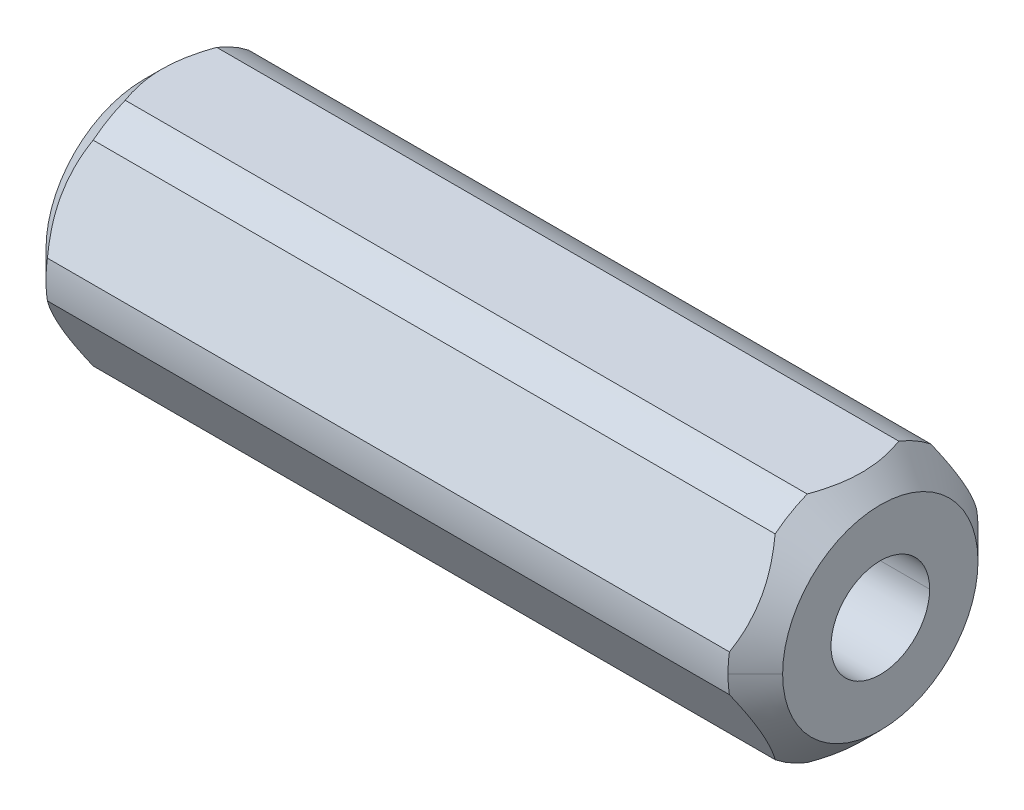
ISO-10303-21;
HEADER;
FILE_DESCRIPTION(('STEP AP214'),'2;1');
FILE_NAME('part.step','',(''),(''),'','','');
FILE_SCHEMA(('AUTOMOTIVE_DESIGN { 1 0 10303 214 1 1 1 1 }'));
ENDSEC;
DATA;
#1=APPLICATION_CONTEXT('core data for automotive mechanical design processes');
#2=APPLICATION_PROTOCOL_DEFINITION('international standard','automotive_design',2000,#1);
#3=PRODUCT_CONTEXT('',#1,'mechanical');
#4=PRODUCT('Part','Part','',(#3));
#5=PRODUCT_RELATED_PRODUCT_CATEGORY('part','',(#4));
#6=PRODUCT_DEFINITION_FORMATION('','',#4);
#7=PRODUCT_DEFINITION_CONTEXT('part definition',#1,'design');
#8=PRODUCT_DEFINITION('design','',#6,#7);
#9=PRODUCT_DEFINITION_SHAPE('','',#8);
#10=(LENGTH_UNIT() NAMED_UNIT(*) SI_UNIT(.MILLI.,.METRE.));
#11=(NAMED_UNIT(*) PLANE_ANGLE_UNIT() SI_UNIT($,.RADIAN.));
#12=(NAMED_UNIT(*) SI_UNIT($,.STERADIAN.) SOLID_ANGLE_UNIT());
#13=UNCERTAINTY_MEASURE_WITH_UNIT(LENGTH_MEASURE(1.E-05),#10,'distance_accuracy_value','');
#14=(GEOMETRIC_REPRESENTATION_CONTEXT(3) GLOBAL_UNCERTAINTY_ASSIGNED_CONTEXT((#13)) GLOBAL_UNIT_ASSIGNED_CONTEXT((#10,
#11,#12)) REPRESENTATION_CONTEXT('',''));
#15=CARTESIAN_POINT('',(0.,0.,0.));
#16=DIRECTION('',(0.,0.,1.));
#17=DIRECTION('',(1.,0.,0.));
#18=AXIS2_PLACEMENT_3D('',#15,#16,#17);
#19=CARTESIAN_POINT('',(-15.08125,0.,0.));
#20=DIRECTION('',(1.,0.,0.));
#21=DIRECTION('',(0.,0.,-1.));
#22=AXIS2_PLACEMENT_3D('',#19,#20,#21);
#23=CYLINDRICAL_SURFACE('',#22,5.1181);
#24=CARTESIAN_POINT('',(-13.96315,0.,0.));
#25=DIRECTION('',(1.,0.,0.));
#26=DIRECTION('',(0.,0.,-1.));
#27=AXIS2_PLACEMENT_3D('',#24,#25,#26);
#28=CIRCLE('',#27,5.1181);
#29=CARTESIAN_POINT('',(-13.96315,4.7625,1.87444428031358));
#30=VERTEX_POINT('',#29);
#31=CARTESIAN_POINT('',(-13.96315,4.00456636472995,3.18722384536662));
#32=VERTEX_POINT('',#31);
#33=EDGE_CURVE('E603',#30,#32,#28,.T.);
#34=ORIENTED_EDGE('',*,*,#33,.T.);
#35=DIRECTION('',(1.,0.,0.));
#36=VECTOR('',#35,1.);
#37=CARTESIAN_POINT('',(-15.08125,4.00456636472995,3.18722384536662));
#38=LINE('',#37,#36);
#39=CARTESIAN_POINT('',(13.96315,4.00456636472997,3.1872238453666));
#40=VERTEX_POINT('',#39);
#41=EDGE_CURVE('E619',#32,#40,#38,.T.);
#42=ORIENTED_EDGE('',*,*,#41,.T.);
#43=CARTESIAN_POINT('',(13.96315,0.,0.));
#44=DIRECTION('',(-1.,0.,0.));
#45=DIRECTION('',(0.,0.,1.));
#46=AXIS2_PLACEMENT_3D('',#43,#44,#45);
#47=CIRCLE('',#46,5.1181);
#48=CARTESIAN_POINT('',(13.96315,4.7625,1.87444428031359));
#49=VERTEX_POINT('',#48);
#50=EDGE_CURVE('E219',#40,#49,#47,.T.);
#51=ORIENTED_EDGE('',*,*,#50,.T.);
#52=DIRECTION('',(-1.,0.,0.));
#53=VECTOR('',#52,1.);
#54=CARTESIAN_POINT('',(-15.08125,4.7625,1.87444428031358));
#55=LINE('',#54,#53);
#56=EDGE_CURVE('E514',#49,#30,#55,.T.);
#57=ORIENTED_EDGE('',*,*,#56,.T.);
#58=EDGE_LOOP('',(#34,#42,#51,#57));
#59=FACE_BOUND('',#58,.T.);
#60=ADVANCED_FACE('F16',(#59),#23,.T.);
#61=CARTESIAN_POINT('',(-15.08125,0.,0.));
#62=DIRECTION('',(1.,0.,0.));
#63=DIRECTION('',(0.,0.,-1.));
#64=AXIS2_PLACEMENT_3D('',#61,#62,#63);
#65=CYLINDRICAL_SURFACE('',#64,5.1181);
#66=CARTESIAN_POINT('',(-13.96315,0.,0.));
#67=DIRECTION('',(1.,0.,0.));
#68=DIRECTION('',(0.,0.,-1.));
#69=AXIS2_PLACEMENT_3D('',#66,#67,#68);
#70=CIRCLE('',#69,5.1181);
#71=CARTESIAN_POINT('',(-13.96315,4.00456636472997,-3.18722384536659));
#72=VERTEX_POINT('',#71);
#73=CARTESIAN_POINT('',(-13.96315,4.7625,-1.87444428031355));
#74=VERTEX_POINT('',#73);
#75=EDGE_CURVE('E575',#72,#74,#70,.T.);
#76=ORIENTED_EDGE('',*,*,#75,.T.);
#77=DIRECTION('',(1.,0.,0.));
#78=VECTOR('',#77,1.);
#79=CARTESIAN_POINT('',(-15.08125,4.7625,-1.87444428031355));
#80=LINE('',#79,#78);
#81=CARTESIAN_POINT('',(13.96315,4.7625,-1.87444428031353));
#82=VERTEX_POINT('',#81);
#83=EDGE_CURVE('E523',#74,#82,#80,.T.);
#84=ORIENTED_EDGE('',*,*,#83,.T.);
#85=CARTESIAN_POINT('',(13.96315,0.,0.));
#86=DIRECTION('',(-1.,0.,0.));
#87=DIRECTION('',(0.,0.,1.));
#88=AXIS2_PLACEMENT_3D('',#85,#86,#87);
#89=CIRCLE('',#88,5.1181);
#90=CARTESIAN_POINT('',(13.96315,4.00456636472995,-3.1872238453666));
#91=VERTEX_POINT('',#90);
#92=EDGE_CURVE('E168',#82,#91,#89,.T.);
#93=ORIENTED_EDGE('',*,*,#92,.T.);
#94=DIRECTION('',(-1.,0.,0.));
#95=VECTOR('',#94,1.);
#96=CARTESIAN_POINT('',(-15.08125,4.00456636472997,-3.18722384536659));
#97=LINE('',#96,#95);
#98=EDGE_CURVE('E493',#91,#72,#97,.T.);
#99=ORIENTED_EDGE('',*,*,#98,.T.);
#100=EDGE_LOOP('',(#76,#84,#93,#99));
#101=FACE_BOUND('',#100,.T.);
#102=ADVANCED_FACE('F887',(#101),#65,.T.);
#103=CARTESIAN_POINT('',(-15.08125,0.,0.));
#104=DIRECTION('',(1.,0.,0.));
#105=DIRECTION('',(0.,0.,-1.));
#106=AXIS2_PLACEMENT_3D('',#103,#104,#105);
#107=CYLINDRICAL_SURFACE('',#106,5.1181);
#108=DIRECTION('',(1.,0.,0.));
#109=VECTOR('',#108,1.);
#110=CARTESIAN_POINT('',(-15.08125,0.,-5.1181));
#111=LINE('',#110,#109);
#112=CARTESIAN_POINT('',(-13.96315,0.,-5.1181));
#113=VERTEX_POINT('',#112);
#114=CARTESIAN_POINT('',(13.96315,0.,-5.1181));
#115=VERTEX_POINT('',#114);
#116=EDGE_CURVE('E256',#113,#115,#111,.T.);
#117=ORIENTED_EDGE('',*,*,#116,.F.);
#118=CARTESIAN_POINT('',(-13.96315,0.,0.));
#119=DIRECTION('',(1.,0.,0.));
#120=DIRECTION('',(0.,0.,-1.));
#121=AXIS2_PLACEMENT_3D('',#118,#119,#120);
#122=CIRCLE('',#121,5.1181);
#123=CARTESIAN_POINT('',(-13.96315,0.757933635270015,-5.06166812568015));
#124=VERTEX_POINT('',#123);
#125=EDGE_CURVE('E569',#113,#124,#122,.T.);
#126=ORIENTED_EDGE('',*,*,#125,.T.);
#127=DIRECTION('',(1.,0.,0.));
#128=VECTOR('',#127,1.);
#129=CARTESIAN_POINT('',(-15.08125,0.757933635270015,-5.06166812568015));
#130=LINE('',#129,#128);
#131=CARTESIAN_POINT('',(13.96315,0.757933635270053,-5.06166812568013));
#132=VERTEX_POINT('',#131);
#133=EDGE_CURVE('E540',#124,#132,#130,.T.);
#134=ORIENTED_EDGE('',*,*,#133,.T.);
#135=CARTESIAN_POINT('',(13.96315,0.,0.));
#136=DIRECTION('',(-1.,0.,0.));
#137=DIRECTION('',(0.,0.,1.));
#138=AXIS2_PLACEMENT_3D('',#135,#136,#137);
#139=CIRCLE('',#138,5.1181);
#140=EDGE_CURVE('E179',#132,#115,#139,.T.);
#141=ORIENTED_EDGE('',*,*,#140,.T.);
#142=EDGE_LOOP('',(#117,#126,#134,#141));
#143=FACE_BOUND('',#142,.T.);
#144=ADVANCED_FACE('F559',(#143),#107,.T.);
#145=CARTESIAN_POINT('',(-15.08125,0.,0.));
#146=DIRECTION('',(1.,0.,0.));
#147=DIRECTION('',(0.,0.,-1.));
#148=AXIS2_PLACEMENT_3D('',#145,#146,#147);
#149=CYLINDRICAL_SURFACE('',#148,5.1181);
#150=CARTESIAN_POINT('',(-13.96315,0.,0.));
#151=DIRECTION('',(1.,0.,0.));
#152=DIRECTION('',(0.,0.,-1.));
#153=AXIS2_PLACEMENT_3D('',#150,#151,#152);
#154=CIRCLE('',#153,5.1181);
#155=CARTESIAN_POINT('',(-13.96315,-4.7625,-1.87444428031361));
#156=VERTEX_POINT('',#155);
#157=CARTESIAN_POINT('',(-13.96315,-4.00456636472992,-3.18722384536665));
#158=VERTEX_POINT('',#157);
#159=EDGE_CURVE('E43',#156,#158,#154,.T.);
#160=ORIENTED_EDGE('',*,*,#159,.T.);
#161=DIRECTION('',(1.,0.,0.));
#162=VECTOR('',#161,1.);
#163=CARTESIAN_POINT('',(-15.08125,-4.00456636472992,-3.18722384536665));
#164=LINE('',#163,#162);
#165=CARTESIAN_POINT('',(13.96315,-4.0045663647299,-3.18722384536667));
#166=VERTEX_POINT('',#165);
#167=EDGE_CURVE('E433',#158,#166,#164,.T.);
#168=ORIENTED_EDGE('',*,*,#167,.T.);
#169=CARTESIAN_POINT('',(13.96315,0.,0.));
#170=DIRECTION('',(-1.,0.,0.));
#171=DIRECTION('',(0.,0.,1.));
#172=AXIS2_PLACEMENT_3D('',#169,#170,#171);
#173=CIRCLE('',#172,5.1181);
#174=CARTESIAN_POINT('',(13.96315,-4.7625,-1.87444428031359));
#175=VERTEX_POINT('',#174);
#176=EDGE_CURVE('E737',#166,#175,#173,.T.);
#177=ORIENTED_EDGE('',*,*,#176,.T.);
#178=DIRECTION('',(-1.,0.,0.));
#179=VECTOR('',#178,1.);
#180=CARTESIAN_POINT('',(-15.08125,-4.7625,-1.87444428031361));
#181=LINE('',#180,#179);
#182=EDGE_CURVE('E657',#175,#156,#181,.T.);
#183=ORIENTED_EDGE('',*,*,#182,.T.);
#184=EDGE_LOOP('',(#160,#168,#177,#183));
#185=FACE_BOUND('',#184,.T.);
#186=ADVANCED_FACE('F821',(#185),#149,.T.);
#187=CARTESIAN_POINT('',(-15.08125,0.,0.));
#188=DIRECTION('',(1.,0.,0.));
#189=DIRECTION('',(0.,0.,-1.));
#190=AXIS2_PLACEMENT_3D('',#187,#188,#189);
#191=CYLINDRICAL_SURFACE('',#190,5.1181);
#192=CARTESIAN_POINT('',(-13.96315,0.,0.));
#193=DIRECTION('',(1.,0.,0.));
#194=DIRECTION('',(0.,0.,-1.));
#195=AXIS2_PLACEMENT_3D('',#192,#193,#194);
#196=CIRCLE('',#195,5.1181);
#197=CARTESIAN_POINT('',(-13.96315,-4.00456636473,3.18722384536655));
#198=VERTEX_POINT('',#197);
#199=CARTESIAN_POINT('',(-13.96315,-4.7625,1.87444428031351));
#200=VERTEX_POINT('',#199);
#201=EDGE_CURVE('E294',#198,#200,#196,.T.);
#202=ORIENTED_EDGE('',*,*,#201,.T.);
#203=DIRECTION('',(1.,0.,0.));
#204=VECTOR('',#203,1.);
#205=CARTESIAN_POINT('',(-15.08125,-4.7625,1.87444428031351));
#206=LINE('',#205,#204);
#207=CARTESIAN_POINT('',(13.96315,-4.7625,1.87444428031352));
#208=VERTEX_POINT('',#207);
#209=EDGE_CURVE('E338',#200,#208,#206,.T.);
#210=ORIENTED_EDGE('',*,*,#209,.T.);
#211=CARTESIAN_POINT('',(13.96315,0.,0.));
#212=DIRECTION('',(-1.,0.,0.));
#213=DIRECTION('',(0.,0.,1.));
#214=AXIS2_PLACEMENT_3D('',#211,#212,#213);
#215=CIRCLE('',#214,5.1181);
#216=CARTESIAN_POINT('',(13.96315,-4.00456636473002,3.18722384536654));
#217=VERTEX_POINT('',#216);
#218=EDGE_CURVE('E629',#208,#217,#215,.T.);
#219=ORIENTED_EDGE('',*,*,#218,.T.);
#220=DIRECTION('',(-1.,0.,0.));
#221=VECTOR('',#220,1.);
#222=CARTESIAN_POINT('',(-15.08125,-4.00456636473,3.18722384536655));
#223=LINE('',#222,#221);
#224=EDGE_CURVE('E334',#217,#198,#223,.T.);
#225=ORIENTED_EDGE('',*,*,#224,.T.);
#226=EDGE_LOOP('',(#202,#210,#219,#225));
#227=FACE_BOUND('',#226,.T.);
#228=ADVANCED_FACE('F414',(#227),#191,.T.);
#229=CARTESIAN_POINT('',(-15.08125,0.,0.));
#230=DIRECTION('',(1.,0.,0.));
#231=DIRECTION('',(0.,0.,-1.));
#232=AXIS2_PLACEMENT_3D('',#229,#230,#231);
#233=CYLINDRICAL_SURFACE('',#232,5.1181);
#234=CARTESIAN_POINT('',(-13.96315,0.,0.));
#235=DIRECTION('',(1.,0.,0.));
#236=DIRECTION('',(0.,0.,-1.));
#237=AXIS2_PLACEMENT_3D('',#234,#235,#236);
#238=CIRCLE('',#237,5.1181);
#239=CARTESIAN_POINT('',(-13.96315,0.75793363526998,5.06166812568015));
#240=VERTEX_POINT('',#239);
#241=CARTESIAN_POINT('',(-13.96315,0.,5.1181));
#242=VERTEX_POINT('',#241);
#243=EDGE_CURVE('E254',#240,#242,#238,.T.);
#244=ORIENTED_EDGE('',*,*,#243,.T.);
#245=CARTESIAN_POINT('',(-13.96315,0.,0.));
#246=DIRECTION('',(1.,0.,0.));
#247=DIRECTION('',(0.,0.,-1.));
#248=AXIS2_PLACEMENT_3D('',#245,#246,#247);
#249=CIRCLE('',#248,5.1181);
#250=CARTESIAN_POINT('',(-13.96315,-0.757933635270046,5.06166812568014));
#251=VERTEX_POINT('',#250);
#252=EDGE_CURVE('E158',#242,#251,#249,.T.);
#253=ORIENTED_EDGE('',*,*,#252,.T.);
#254=DIRECTION('',(1.,0.,0.));
#255=VECTOR('',#254,1.);
#256=CARTESIAN_POINT('',(-15.08125,-0.757933635270046,5.06166812568014));
#257=LINE('',#256,#255);
#258=CARTESIAN_POINT('',(13.96315,-0.757933635270013,5.06166812568016));
#259=VERTEX_POINT('',#258);
#260=EDGE_CURVE('E225',#251,#259,#257,.T.);
#261=ORIENTED_EDGE('',*,*,#260,.T.);
#262=CARTESIAN_POINT('',(13.96315,0.,0.));
#263=DIRECTION('',(-1.,0.,0.));
#264=DIRECTION('',(0.,0.,1.));
#265=AXIS2_PLACEMENT_3D('',#262,#263,#264);
#266=CIRCLE('',#265,5.1181);
#267=CARTESIAN_POINT('',(13.96315,0.,5.1181));
#268=VERTEX_POINT('',#267);
#269=EDGE_CURVE('E222',#259,#268,#266,.T.);
#270=ORIENTED_EDGE('',*,*,#269,.T.);
#271=CARTESIAN_POINT('',(13.96315,0.,0.));
#272=DIRECTION('',(-1.,0.,0.));
#273=DIRECTION('',(0.,0.,1.));
#274=AXIS2_PLACEMENT_3D('',#271,#272,#273);
#275=CIRCLE('',#274,5.1181);
#276=CARTESIAN_POINT('',(13.96315,0.757933635269943,5.06166812568017));
#277=VERTEX_POINT('',#276);
#278=EDGE_CURVE('E209',#268,#277,#275,.T.);
#279=ORIENTED_EDGE('',*,*,#278,.T.);
#280=DIRECTION('',(-1.,0.,0.));
#281=VECTOR('',#280,1.);
#282=CARTESIAN_POINT('',(-15.08125,0.75793363526998,5.06166812568015));
#283=LINE('',#282,#281);
#284=EDGE_CURVE('E146',#277,#240,#283,.T.);
#285=ORIENTED_EDGE('',*,*,#284,.T.);
#286=EDGE_LOOP('',(#244,#253,#261,#270,#279,#285));
#287=FACE_BOUND('',#286,.T.);
#288=ADVANCED_FACE('F223',(#287),#233,.T.);
#289=CARTESIAN_POINT('',(15.08125,0.,0.));
#290=DIRECTION('',(1.,0.,0.));
#291=DIRECTION('',(0.,0.,-1.));
#292=AXIS2_PLACEMENT_3D('',#289,#290,#291);
#293=CYLINDRICAL_SURFACE('',#292,2.0193);
#294=DIRECTION('',(1.,0.,0.));
#295=VECTOR('',#294,1.);
#296=CARTESIAN_POINT('',(15.08125,0.,2.0193));
#297=LINE('',#296,#295);
#298=CARTESIAN_POINT('',(-15.08125,0.,2.0193));
#299=VERTEX_POINT('',#298);
#300=CARTESIAN_POINT('',(15.08125,0.,2.0193));
#301=VERTEX_POINT('',#300);
#302=EDGE_CURVE('E262',#299,#301,#297,.T.);
#303=ORIENTED_EDGE('',*,*,#302,.F.);
#304=CARTESIAN_POINT('',(-15.08125,0.,0.));
#305=DIRECTION('',(-1.,0.,0.));
#306=DIRECTION('',(0.,0.,1.));
#307=AXIS2_PLACEMENT_3D('',#304,#305,#306);
#308=CIRCLE('',#307,2.0193);
#309=CARTESIAN_POINT('',(-15.08125,0.,-2.0193));
#310=VERTEX_POINT('',#309);
#311=EDGE_CURVE('E11',#299,#310,#308,.T.);
#312=ORIENTED_EDGE('',*,*,#311,.T.);
#313=DIRECTION('',(1.,0.,0.));
#314=VECTOR('',#313,1.);
#315=CARTESIAN_POINT('',(15.08125,0.,-2.0193));
#316=LINE('',#315,#314);
#317=CARTESIAN_POINT('',(15.08125,0.,-2.0193));
#318=VERTEX_POINT('',#317);
#319=EDGE_CURVE('E240',#310,#318,#316,.T.);
#320=ORIENTED_EDGE('',*,*,#319,.T.);
#321=CARTESIAN_POINT('',(15.08125,0.,0.));
#322=DIRECTION('',(1.,0.,0.));
#323=DIRECTION('',(0.,0.,-1.));
#324=AXIS2_PLACEMENT_3D('',#321,#322,#323);
#325=CIRCLE('',#324,2.0193);
#326=EDGE_CURVE('E28',#318,#301,#325,.T.);
#327=ORIENTED_EDGE('',*,*,#326,.T.);
#328=EDGE_LOOP('',(#303,#312,#320,#327));
#329=FACE_BOUND('',#328,.T.);
#330=ADVANCED_FACE('F306',(#329),#293,.F.);
#331=CARTESIAN_POINT('',(-15.08125,0.,0.));
#332=DIRECTION('',(1.,0.,0.));
#333=DIRECTION('',(0.,1.,0.));
#334=AXIS2_PLACEMENT_3D('',#331,#332,#333);
#335=PLANE('',#334);
#336=CARTESIAN_POINT('',(-15.08125,0.,0.));
#337=DIRECTION('',(-1.,0.,0.));
#338=DIRECTION('',(0.,0.,1.));
#339=AXIS2_PLACEMENT_3D('',#336,#337,#338);
#340=CIRCLE('',#339,2.0193);
#341=EDGE_CURVE('E267',#310,#299,#340,.T.);
#342=ORIENTED_EDGE('',*,*,#341,.F.);
#343=ORIENTED_EDGE('',*,*,#311,.F.);
#344=EDGE_LOOP('',(#342,#343));
#345=FACE_BOUND('',#344,.T.);
#346=CARTESIAN_POINT('',(-15.08125,0.,0.));
#347=DIRECTION('',(1.,0.,0.));
#348=DIRECTION('',(0.,0.,-1.));
#349=AXIS2_PLACEMENT_3D('',#346,#347,#348);
#350=CIRCLE('',#349,4.);
#351=CARTESIAN_POINT('',(-15.08125,0.,-4.));
#352=VERTEX_POINT('',#351);
#353=CARTESIAN_POINT('',(-15.08125,0.,4.));
#354=VERTEX_POINT('',#353);
#355=EDGE_CURVE('E255',#352,#354,#350,.T.);
#356=ORIENTED_EDGE('',*,*,#355,.F.);
#357=CARTESIAN_POINT('',(-15.08125,0.,0.));
#358=DIRECTION('',(1.,0.,0.));
#359=DIRECTION('',(0.,0.,-1.));
#360=AXIS2_PLACEMENT_3D('',#357,#358,#359);
#361=CIRCLE('',#360,4.);
#362=EDGE_CURVE('E244',#354,#352,#361,.T.);
#363=ORIENTED_EDGE('',*,*,#362,.F.);
#364=EDGE_LOOP('',(#356,#363));
#365=FACE_BOUND('',#364,.T.);
#366=ADVANCED_FACE('F840',(#345,#365),#335,.F.);
#367=CARTESIAN_POINT('',(15.08125,0.,0.));
#368=DIRECTION('',(1.,0.,0.));
#369=DIRECTION('',(0.,1.,0.));
#370=AXIS2_PLACEMENT_3D('',#367,#368,#369);
#371=PLANE('',#370);
#372=ORIENTED_EDGE('',*,*,#326,.F.);
#373=CARTESIAN_POINT('',(15.08125,0.,0.));
#374=DIRECTION('',(1.,0.,0.));
#375=DIRECTION('',(0.,0.,-1.));
#376=AXIS2_PLACEMENT_3D('',#373,#374,#375);
#377=CIRCLE('',#376,2.0193);
#378=EDGE_CURVE('E266',#301,#318,#377,.T.);
#379=ORIENTED_EDGE('',*,*,#378,.F.);
#380=EDGE_LOOP('',(#372,#379));
#381=FACE_BOUND('',#380,.T.);
#382=CARTESIAN_POINT('',(15.08125,0.,0.));
#383=DIRECTION('',(1.,0.,0.));
#384=DIRECTION('',(0.,0.,-1.));
#385=AXIS2_PLACEMENT_3D('',#382,#383,#384);
#386=CIRCLE('',#385,4.);
#387=CARTESIAN_POINT('',(15.08125,0.,-4.));
#388=VERTEX_POINT('',#387);
#389=CARTESIAN_POINT('',(15.08125,0.,4.));
#390=VERTEX_POINT('',#389);
#391=EDGE_CURVE('E202',#388,#390,#386,.T.);
#392=ORIENTED_EDGE('',*,*,#391,.T.);
#393=CARTESIAN_POINT('',(15.08125,0.,0.));
#394=DIRECTION('',(1.,0.,0.));
#395=DIRECTION('',(0.,0.,-1.));
#396=AXIS2_PLACEMENT_3D('',#393,#394,#395);
#397=CIRCLE('',#396,4.);
#398=EDGE_CURVE('E233',#390,#388,#397,.T.);
#399=ORIENTED_EDGE('',*,*,#398,.T.);
#400=EDGE_LOOP('',(#392,#399));
#401=FACE_BOUND('',#400,.T.);
#402=ADVANCED_FACE('F502',(#381,#401),#371,.T.);
#403=CARTESIAN_POINT('',(15.08125,0.,0.));
#404=DIRECTION('',(-1.,0.,0.));
#405=DIRECTION('',(0.,0.,-1.));
#406=AXIS2_PLACEMENT_3D('',#403,#404,#405);
#407=CONICAL_SURFACE('',#406,4.,0.785398163397452);
#408=DIRECTION('',(-0.707106781186546,0.,0.70710678118655));
#409=VECTOR('',#408,1.);
#410=CARTESIAN_POINT('',(15.08125,0.,4.));
#411=LINE('',#410,#409);
#412=EDGE_CURVE('E213',#390,#268,#411,.T.);
#413=ORIENTED_EDGE('',*,*,#412,.F.);
#414=ORIENTED_EDGE('',*,*,#391,.F.);
#415=DIRECTION('',(-0.707106781186544,0.,-0.707106781186551));
#416=VECTOR('',#415,1.);
#417=CARTESIAN_POINT('',(15.08125,0.,-4.));
#418=LINE('',#417,#416);
#419=EDGE_CURVE('E271',#388,#115,#418,.T.);
#420=ORIENTED_EDGE('',*,*,#419,.T.);
#421=ORIENTED_EDGE('',*,*,#140,.F.);
#422=CARTESIAN_POINT('',(13.96315,4.00456636472995,-3.1872238453666));
#423=CARTESIAN_POINT('',(14.1345095516406,3.59936100536162,-3.42116926867498));
#424=CARTESIAN_POINT('',(14.2225925883791,3.21423210972654,-3.6435235402426));
#425=CARTESIAN_POINT('',(14.3181857082262,2.79626658491892,-3.88483604850226));
#426=CARTESIAN_POINT('',(14.3187472824251,2.38565609594242,-4.12190212484493));
#427=CARTESIAN_POINT('',(14.3193046673556,1.97810870629893,-4.35719971996313));
#428=CARTESIAN_POINT('',(14.2256279786887,1.56164996163835,-4.59764228829929));
#429=CARTESIAN_POINT('',(14.1376687723271,1.17060944575305,-4.82340963540971));
#430=CARTESIAN_POINT('',(13.96315,0.757933635270051,-5.06166812568012));
#431=B_SPLINE_CURVE_WITH_KNOTS('',2,(#422,#423,#424,#425,#426,#427,#428,#429,#430),
.UNSPECIFIED.,.F.,.F.,(3,2,2,2,3),(0.,0.25,0.5,0.75,1.),.UNSPECIFIED.);
#432=EDGE_CURVE('E489',#91,#132,#431,.T.);
#433=ORIENTED_EDGE('',*,*,#432,.F.);
#434=ORIENTED_EDGE('',*,*,#92,.F.);
#435=CARTESIAN_POINT('',(13.96315,4.76249999999998,1.87444428031359));
#436=CARTESIAN_POINT('',(14.1363946286034,4.76249999999999,1.40140630155513));
#437=CARTESIAN_POINT('',(14.2245355058082,4.76249999999999,0.95198184231296));
#438=CARTESIAN_POINT('',(14.3187739664225,4.76249999999999,0.471466211602435));
#439=CARTESIAN_POINT('',(14.3187499335083,4.76249999999999,-0.00079582275992968));
#440=CARTESIAN_POINT('',(14.3187039898749,4.76249999999999,-0.903617409282465));
#441=CARTESIAN_POINT('',(13.96315,4.7625,-1.87444428031352));
#442=B_SPLINE_CURVE_WITH_KNOTS('',2,(#435,#436,#437,#438,#439,#440,#441),.UNSPECIFIED.,.F.,.F.,
(3,2,2,3),(0.,0.25,0.5,1.),.UNSPECIFIED.);
#443=EDGE_CURVE('E522',#49,#82,#442,.T.);
#444=ORIENTED_EDGE('',*,*,#443,.F.);
#445=ORIENTED_EDGE('',*,*,#50,.F.);
#446=CARTESIAN_POINT('',(13.96315,0.75793363526997,5.0616681256802));
#447=CARTESIAN_POINT('',(14.1345095516449,1.16313899464847,4.82772270236594));
#448=CARTESIAN_POINT('',(14.2225925883791,1.54826789027341,4.60536843080418));
#449=CARTESIAN_POINT('',(14.3181857082262,1.96623341509056,4.36405592253902));
#450=CARTESIAN_POINT('',(14.3187472824251,2.37684390405757,4.12698984620183));
#451=CARTESIAN_POINT('',(14.3193046673556,2.78439129370428,3.89169225108177));
#452=CARTESIAN_POINT('',(14.2256279786887,3.20085003836167,3.65124968274746));
#453=CARTESIAN_POINT('',(14.1376687723256,3.59189055425039,3.42548233563506));
#454=CARTESIAN_POINT('',(13.96315,4.00456636473,3.18722384536661));
#455=B_SPLINE_CURVE_WITH_KNOTS('',2,(#446,#447,#448,#449,#450,#451,#452,#453,#454),
.UNSPECIFIED.,.F.,.F.,(3,2,2,2,3),(0.,0.25,0.5,0.75,1.),.UNSPECIFIED.);
#456=EDGE_CURVE('E216',#277,#40,#455,.T.);
#457=ORIENTED_EDGE('',*,*,#456,.F.);
#458=ORIENTED_EDGE('',*,*,#278,.F.);
#459=EDGE_LOOP('',(#413,#414,#420,#421,#433,#434,#444,#445,#457,#458));
#460=FACE_BOUND('',#459,.T.);
#461=ADVANCED_FACE('F211',(#460),#407,.T.);
#462=CARTESIAN_POINT('',(-15.08125,0.,0.));
#463=DIRECTION('',(1.,0.,0.));
#464=DIRECTION('',(0.,0.,-1.));
#465=AXIS2_PLACEMENT_3D('',#462,#463,#464);
#466=CONICAL_SURFACE('',#465,4.,0.785398163397452);
#467=DIRECTION('',(0.707106781186546,0.,0.70710678118655));
#468=VECTOR('',#467,1.);
#469=CARTESIAN_POINT('',(-15.08125,0.,4.));
#470=LINE('',#469,#468);
#471=EDGE_CURVE('E250',#354,#242,#470,.T.);
#472=ORIENTED_EDGE('',*,*,#471,.F.);
#473=ORIENTED_EDGE('',*,*,#362,.T.);
#474=DIRECTION('',(0.707106781186544,0.,-0.707106781186551));
#475=VECTOR('',#474,1.);
#476=CARTESIAN_POINT('',(-15.08125,0.,-4.));
#477=LINE('',#476,#475);
#478=EDGE_CURVE('E441',#352,#113,#477,.T.);
#479=ORIENTED_EDGE('',*,*,#478,.T.);
#480=CARTESIAN_POINT('',(-13.96315,0.,0.));
#481=DIRECTION('',(1.,0.,0.));
#482=DIRECTION('',(0.,0.,-1.));
#483=AXIS2_PLACEMENT_3D('',#480,#481,#482);
#484=CIRCLE('',#483,5.1181);
#485=CARTESIAN_POINT('',(-13.96315,-0.757933635270031,-5.06166812568015));
#486=VERTEX_POINT('',#485);
#487=EDGE_CURVE('E261',#486,#113,#484,.T.);
#488=ORIENTED_EDGE('',*,*,#487,.F.);
#489=CARTESIAN_POINT('',(-13.96315,-4.00456636472997,-3.18722384536666));
#490=CARTESIAN_POINT('',(-14.1345095516452,-3.59936100535099,-3.4211692686812));
#491=CARTESIAN_POINT('',(-14.2225925883791,-3.21423210972656,-3.64352354024266));
#492=CARTESIAN_POINT('',(-14.3181857082231,-2.7962665849224,-3.88483604850033));
#493=CARTESIAN_POINT('',(-14.3187472824251,-2.38565609594245,-4.12190212484499));
#494=CARTESIAN_POINT('',(-14.3193046673586,-1.97810870631244,-4.3571997199554));
#495=CARTESIAN_POINT('',(-14.2256279786887,-1.56164996163838,-4.59764228829934));
#496=CARTESIAN_POINT('',(-14.1376687723271,-1.17060944575319,-4.8234096354097));
#497=CARTESIAN_POINT('',(-13.96315,-0.757933635270083,-5.06166812568017));
#498=B_SPLINE_CURVE_WITH_KNOTS('',2,(#489,#490,#491,#492,#493,#494,#495,#496,#497),
.UNSPECIFIED.,.F.,.F.,(3,2,2,2,3),(0.,0.25,0.5,0.75,1.),.UNSPECIFIED.);
#499=EDGE_CURVE('E429',#158,#486,#498,.T.);
#500=ORIENTED_EDGE('',*,*,#499,.F.);
#501=ORIENTED_EDGE('',*,*,#159,.F.);
#502=CARTESIAN_POINT('',(-13.96315,-4.76249999999999,1.87444428031351));
#503=CARTESIAN_POINT('',(-14.1363946286001,-4.76249999999999,1.40140630156385));
#504=CARTESIAN_POINT('',(-14.2245355058082,-4.76249999999998,0.95198184231288));
#505=CARTESIAN_POINT('',(-14.3187739664203,-4.76249999999998,0.471466211621955));
#506=CARTESIAN_POINT('',(-14.3187499335083,-4.76249999999997,-0.000795822760010344));
#507=CARTESIAN_POINT('',(-14.3187039898792,-4.76249999999996,-0.903617409270875));
#508=CARTESIAN_POINT('',(-13.96315,-4.76249999999995,-1.87444428031361));
#509=B_SPLINE_CURVE_WITH_KNOTS('',2,(#502,#503,#504,#505,#506,#507,#508),.UNSPECIFIED.,.F.,.F.,
(3,2,2,3),(0.,0.25,0.5,1.),.UNSPECIFIED.);
#510=EDGE_CURVE('E280',#200,#156,#509,.T.);
#511=ORIENTED_EDGE('',*,*,#510,.F.);
#512=ORIENTED_EDGE('',*,*,#201,.F.);
#513=CARTESIAN_POINT('',(-13.96315,-0.757933635270047,5.06166812568014));
#514=CARTESIAN_POINT('',(-14.134509551642,-1.1631389946415,4.82772270236995));
#515=CARTESIAN_POINT('',(-14.2225925883791,-1.54826789027347,4.60536843080412));
#516=CARTESIAN_POINT('',(-14.3181857082262,-1.96623341508401,4.36405592254277));
#517=CARTESIAN_POINT('',(-14.3187472824251,-2.3768439040576,4.12698984620178));
#518=CARTESIAN_POINT('',(-14.3193046673556,-2.7843912937011,3.89169225108357));
#519=CARTESIAN_POINT('',(-14.2256279786888,-3.20085003836169,3.6512496827474));
#520=CARTESIAN_POINT('',(-14.137668772327,-3.59189055424702,3.42548233563696));
#521=CARTESIAN_POINT('',(-13.96315,-4.00456636473,3.18722384536655));
#522=B_SPLINE_CURVE_WITH_KNOTS('',2,(#513,#514,#515,#516,#517,#518,#519,#520,#521),
.UNSPECIFIED.,.F.,.F.,(3,2,2,2,3),(0.,0.25,0.5,0.75,1.),.UNSPECIFIED.);
#523=EDGE_CURVE('E331',#251,#198,#522,.T.);
#524=ORIENTED_EDGE('',*,*,#523,.F.);
#525=ORIENTED_EDGE('',*,*,#252,.F.);
#526=EDGE_LOOP('',(#472,#473,#479,#488,#500,#501,#511,#512,#524,#525));
#527=FACE_BOUND('',#526,.T.);
#528=ADVANCED_FACE('F296',(#527),#466,.T.);
#529=CARTESIAN_POINT('',(15.08125,-4.7625,2.74963065701554));
#530=DIRECTION('',(0.,1.,0.));
#531=DIRECTION('',(0.,0.,-1.));
#532=AXIS2_PLACEMENT_3D('',#529,#530,#531);
#533=PLANE('',#532);
#534=ORIENTED_EDGE('',*,*,#209,.F.);
#535=ORIENTED_EDGE('',*,*,#510,.T.);
#536=ORIENTED_EDGE('',*,*,#182,.F.);
#537=CARTESIAN_POINT('',(13.96315,-4.76249999999995,-1.87444428031359));
#538=CARTESIAN_POINT('',(14.3184927815776,-4.76249999999996,-0.90419410563896));
#539=CARTESIAN_POINT('',(14.3187499335083,-4.76249999999997,-0.000795822759995166));
#540=CARTESIAN_POINT('',(14.3188840549258,-4.76249999999998,0.470385000046795));
#541=CARTESIAN_POINT('',(14.2245355058082,-4.76249999999998,0.951981842312895));
#542=CARTESIAN_POINT('',(14.1365992099488,-4.76249999999999,1.40084769984311));
#543=CARTESIAN_POINT('',(13.96315,-4.76249999999999,1.87444428031352));
#544=B_SPLINE_CURVE_WITH_KNOTS('',2,(#537,#538,#539,#540,#541,#542,#543),.UNSPECIFIED.,.F.,.F.,
(3,2,2,3),(0.,0.5,0.75,1.),.UNSPECIFIED.);
#545=EDGE_CURVE('E764',#175,#208,#544,.T.);
#546=ORIENTED_EDGE('',*,*,#545,.T.);
#547=EDGE_LOOP('',(#534,#535,#536,#546));
#548=FACE_BOUND('',#547,.T.);
#549=ADVANCED_FACE('F18',(#548),#533,.F.);
#550=CARTESIAN_POINT('',(15.08125,0.,5.49926131403116));
#551=DIRECTION('',(0.,0.500000000000007,-0.866025403784435));
#552=DIRECTION('',(-1.,0.,0.));
#553=AXIS2_PLACEMENT_3D('',#550,#551,#552);
#554=PLANE('',#553);
#555=ORIENTED_EDGE('',*,*,#260,.F.);
#556=ORIENTED_EDGE('',*,*,#523,.T.);
#557=ORIENTED_EDGE('',*,*,#224,.F.);
#558=CARTESIAN_POINT('',(13.96315,-4.00456636473002,3.18722384536654));
#559=CARTESIAN_POINT('',(14.1345095516422,-3.5993610053581,3.421169268677));
#560=CARTESIAN_POINT('',(14.2225925883791,-3.21423210972658,3.64352354024257));
#561=CARTESIAN_POINT('',(14.3181857082262,-2.79626658491561,3.88483604850417));
#562=CARTESIAN_POINT('',(14.3187472824251,-2.38565609594243,4.12190212484492));
#563=CARTESIAN_POINT('',(14.3193046673556,-1.97810870629557,4.35719971996507));
#564=CARTESIAN_POINT('',(14.2256279786887,-1.56164996163834,4.5976422882993));
#565=CARTESIAN_POINT('',(14.1376687723255,-1.17060944574936,4.82340963541186));
#566=CARTESIAN_POINT('',(13.96315,-0.757933635270013,5.06166812568016));
#567=B_SPLINE_CURVE_WITH_KNOTS('',2,(#558,#559,#560,#561,#562,#563,#564,#565,#566),
.UNSPECIFIED.,.F.,.F.,(3,2,2,2,3),(0.,0.25,0.5,0.75,1.),.UNSPECIFIED.);
#568=EDGE_CURVE('E230',#217,#259,#567,.T.);
#569=ORIENTED_EDGE('',*,*,#568,.T.);
#570=EDGE_LOOP('',(#555,#556,#557,#569));
#571=FACE_BOUND('',#570,.T.);
#572=ADVANCED_FACE('F358',(#571),#554,.F.);
#573=CARTESIAN_POINT('',(15.08125,4.7625,2.7496306570156));
#574=DIRECTION('',(0.,-0.5,-0.866025403784442));
#575=DIRECTION('',(0.,-0.866025403784442,0.5));
#576=AXIS2_PLACEMENT_3D('',#573,#574,#575);
#577=PLANE('',#576);
#578=ORIENTED_EDGE('',*,*,#41,.F.);
#579=CARTESIAN_POINT('',(-13.9631500000002,4.00456636472998,3.18722384536662));
#580=CARTESIAN_POINT('',(-14.134509551642,3.59936100535882,3.42116926867664));
#581=CARTESIAN_POINT('',(-14.2225925883793,3.21423210972656,3.64352354024263));
#582=CARTESIAN_POINT('',(-14.3181857082264,2.79626658491627,3.88483604850383));
#583=CARTESIAN_POINT('',(-14.3187472824253,2.38565609594242,4.12190212484497));
#584=CARTESIAN_POINT('',(-14.3193046673558,1.97810870629909,4.35719971996307));
#585=CARTESIAN_POINT('',(-14.2256279786889,1.56164996163833,4.59764228829934));
#586=CARTESIAN_POINT('',(-14.1376687723273,1.17060944575318,4.82340963540967));
#587=CARTESIAN_POINT('',(-13.9631500000002,0.757933635270013,5.06166812568017));
#588=B_SPLINE_CURVE_WITH_KNOTS('',2,(#579,#580,#581,#582,#583,#584,#585,#586,#587),
.UNSPECIFIED.,.F.,.F.,(3,2,2,2,3),(0.,0.25,0.5,0.75,1.),.UNSPECIFIED.);
#589=EDGE_CURVE('E381',#32,#240,#588,.T.);
#590=ORIENTED_EDGE('',*,*,#589,.T.);
#591=ORIENTED_EDGE('',*,*,#284,.F.);
#592=ORIENTED_EDGE('',*,*,#456,.T.);
#593=EDGE_LOOP('',(#578,#590,#591,#592));
#594=FACE_BOUND('',#593,.T.);
#595=ADVANCED_FACE('F348',(#594),#577,.F.);
#596=CARTESIAN_POINT('',(15.08125,4.7625,-2.74963065701557));
#597=DIRECTION('',(0.,-1.,0.));
#598=DIRECTION('',(0.,0.,-1.));
#599=AXIS2_PLACEMENT_3D('',#596,#597,#598);
#600=PLANE('',#599);
#601=ORIENTED_EDGE('',*,*,#83,.F.);
#602=CARTESIAN_POINT('',(-13.96315,4.7625,-1.87444428031354));
#603=CARTESIAN_POINT('',(-14.318492781579,4.76249999999999,-0.90419410563503));
#604=CARTESIAN_POINT('',(-14.3187499335083,4.76249999999999,-0.000795822759944859));
#605=CARTESIAN_POINT('',(-14.3188840549251,4.76249999999999,0.47038500005062));
#606=CARTESIAN_POINT('',(-14.2245355058082,4.76249999999999,0.95198184231295));
#607=CARTESIAN_POINT('',(-14.1365992099489,4.76249999999999,1.40084769984302));
#608=CARTESIAN_POINT('',(-13.96315,4.76249999999998,1.87444428031358));
#609=B_SPLINE_CURVE_WITH_KNOTS('',2,(#602,#603,#604,#605,#606,#607,#608),.UNSPECIFIED.,.F.,.F.,
(3,2,2,3),(0.,0.5,0.75,1.),.UNSPECIFIED.);
#610=EDGE_CURVE('E583',#74,#30,#609,.T.);
#611=ORIENTED_EDGE('',*,*,#610,.T.);
#612=ORIENTED_EDGE('',*,*,#56,.F.);
#613=ORIENTED_EDGE('',*,*,#443,.T.);
#614=EDGE_LOOP('',(#601,#611,#612,#613));
#615=FACE_BOUND('',#614,.T.);
#616=ADVANCED_FACE('F308',(#615),#600,.F.);
#617=CARTESIAN_POINT('',(15.08125,0.,-5.49926131403116));
#618=DIRECTION('',(0.,-0.5,0.866025403784438));
#619=DIRECTION('',(-1.,0.,0.));
#620=AXIS2_PLACEMENT_3D('',#617,#618,#619);
#621=PLANE('',#620);
#622=ORIENTED_EDGE('',*,*,#133,.F.);
#623=CARTESIAN_POINT('',(-13.96315,0.757933635270014,-5.06166812568015));
#624=CARTESIAN_POINT('',(-14.1345095516452,1.16313899464901,-4.8277227023656));
#625=CARTESIAN_POINT('',(-14.2225925883791,1.54826789027344,-4.60536843080414));
#626=CARTESIAN_POINT('',(-14.3181857082262,1.96623341509097,-4.36405592253875));
#627=CARTESIAN_POINT('',(-14.3187472824251,2.37684390405757,-4.1269898462018));
#628=CARTESIAN_POINT('',(-14.3193046673556,2.7843912937016,-3.89169225108329));
#629=CARTESIAN_POINT('',(-14.2256279786888,3.20085003836166,-3.65124968274743));
#630=CARTESIAN_POINT('',(-14.1376687723268,3.59189055424755,-3.42548233563666));
#631=CARTESIAN_POINT('',(-13.96315,4.00456636472997,-3.18722384536659));
#632=B_SPLINE_CURVE_WITH_KNOTS('',2,(#623,#624,#625,#626,#627,#628,#629,#630,#631),
.UNSPECIFIED.,.F.,.F.,(3,2,2,2,3),(0.,0.25,0.5,0.75,1.),.UNSPECIFIED.);
#633=EDGE_CURVE('E460',#124,#72,#632,.T.);
#634=ORIENTED_EDGE('',*,*,#633,.T.);
#635=ORIENTED_EDGE('',*,*,#98,.F.);
#636=ORIENTED_EDGE('',*,*,#432,.T.);
#637=EDGE_LOOP('',(#622,#634,#635,#636));
#638=FACE_BOUND('',#637,.T.);
#639=ADVANCED_FACE('F413',(#638),#621,.F.);
#640=CARTESIAN_POINT('',(15.08125,-4.7625,-2.74963065701564));
#641=DIRECTION('',(0.,0.5,0.866025403784442));
#642=DIRECTION('',(1.,0.,0.));
#643=AXIS2_PLACEMENT_3D('',#640,#641,#642);
#644=PLANE('',#643);
#645=ORIENTED_EDGE('',*,*,#167,.F.);
#646=ORIENTED_EDGE('',*,*,#499,.T.);
#647=DIRECTION('',(-1.,0.,0.));
#648=VECTOR('',#647,1.);
#649=CARTESIAN_POINT('',(-15.08125,-0.757933635270031,-5.06166812568015));
#650=LINE('',#649,#648);
#651=CARTESIAN_POINT('',(13.96315,-0.757933635270064,-5.06166812568012));
#652=VERTEX_POINT('',#651);
#653=EDGE_CURVE('E444',#652,#486,#650,.T.);
#654=ORIENTED_EDGE('',*,*,#653,.F.);
#655=CARTESIAN_POINT('',(13.96315,-0.757933635270117,-5.06166812568015));
#656=CARTESIAN_POINT('',(14.1345095516453,-1.16313899464954,-4.82772270236536));
#657=CARTESIAN_POINT('',(14.2225925883791,-1.54826789027351,-4.60536843080416));
#658=CARTESIAN_POINT('',(14.3181857082246,-1.96623341508474,-4.36405592254241));
#659=CARTESIAN_POINT('',(14.3187472824251,-2.37684390405761,-4.12698984620184));
#660=CARTESIAN_POINT('',(14.3193046673571,-2.78439129369093,-3.89169225108952));
#661=CARTESIAN_POINT('',(14.2256279786887,-3.20085003836166,-3.6512496827475));
#662=CARTESIAN_POINT('',(14.1376687723287,-3.59189055424315,-3.42548233563927));
#663=CARTESIAN_POINT('',(13.96315,-4.00456636472995,-3.18722384536667));
#664=B_SPLINE_CURVE_WITH_KNOTS('',2,(#655,#656,#657,#658,#659,#660,#661,#662,#663),
.UNSPECIFIED.,.F.,.F.,(3,2,2,2,3),(0.,0.25,0.5,0.75,1.),.UNSPECIFIED.);
#665=EDGE_CURVE('E274',#652,#166,#664,.T.);
#666=ORIENTED_EDGE('',*,*,#665,.T.);
#667=EDGE_LOOP('',(#645,#646,#654,#666));
#668=FACE_BOUND('',#667,.T.);
#669=ADVANCED_FACE('F404',(#668),#644,.F.);
#670=CARTESIAN_POINT('',(-15.08125,0.,0.));
#671=DIRECTION('',(1.,0.,0.));
#672=DIRECTION('',(0.,0.,-1.));
#673=AXIS2_PLACEMENT_3D('',#670,#671,#672);
#674=CONICAL_SURFACE('',#673,4.,0.785398163397452);
#675=ORIENTED_EDGE('',*,*,#355,.T.);
#676=ORIENTED_EDGE('',*,*,#471,.T.);
#677=ORIENTED_EDGE('',*,*,#243,.F.);
#678=ORIENTED_EDGE('',*,*,#589,.F.);
#679=ORIENTED_EDGE('',*,*,#33,.F.);
#680=ORIENTED_EDGE('',*,*,#610,.F.);
#681=ORIENTED_EDGE('',*,*,#75,.F.);
#682=ORIENTED_EDGE('',*,*,#633,.F.);
#683=ORIENTED_EDGE('',*,*,#125,.F.);
#684=ORIENTED_EDGE('',*,*,#478,.F.);
#685=EDGE_LOOP('',(#675,#676,#677,#678,#679,#680,#681,#682,#683,#684));
#686=FACE_BOUND('',#685,.T.);
#687=ADVANCED_FACE('F361',(#686),#674,.T.);
#688=CARTESIAN_POINT('',(15.08125,0.,0.));
#689=DIRECTION('',(-1.,0.,0.));
#690=DIRECTION('',(0.,0.,-1.));
#691=AXIS2_PLACEMENT_3D('',#688,#689,#690);
#692=CONICAL_SURFACE('',#691,4.,0.785398163397452);
#693=ORIENTED_EDGE('',*,*,#398,.F.);
#694=ORIENTED_EDGE('',*,*,#412,.T.);
#695=ORIENTED_EDGE('',*,*,#269,.F.);
#696=ORIENTED_EDGE('',*,*,#568,.F.);
#697=ORIENTED_EDGE('',*,*,#218,.F.);
#698=ORIENTED_EDGE('',*,*,#545,.F.);
#699=ORIENTED_EDGE('',*,*,#176,.F.);
#700=ORIENTED_EDGE('',*,*,#665,.F.);
#701=CARTESIAN_POINT('',(13.96315,0.,0.));
#702=DIRECTION('',(-1.,0.,0.));
#703=DIRECTION('',(0.,0.,1.));
#704=AXIS2_PLACEMENT_3D('',#701,#702,#703);
#705=CIRCLE('',#704,5.1181);
#706=EDGE_CURVE('E260',#115,#652,#705,.T.);
#707=ORIENTED_EDGE('',*,*,#706,.F.);
#708=ORIENTED_EDGE('',*,*,#419,.F.);
#709=EDGE_LOOP('',(#693,#694,#695,#696,#697,#698,#699,#700,#707,#708));
#710=FACE_BOUND('',#709,.T.);
#711=ADVANCED_FACE('F231',(#710),#692,.T.);
#712=CARTESIAN_POINT('',(15.08125,0.,0.));
#713=DIRECTION('',(1.,0.,0.));
#714=DIRECTION('',(0.,0.,-1.));
#715=AXIS2_PLACEMENT_3D('',#712,#713,#714);
#716=CYLINDRICAL_SURFACE('',#715,2.0193);
#717=ORIENTED_EDGE('',*,*,#341,.T.);
#718=ORIENTED_EDGE('',*,*,#302,.T.);
#719=ORIENTED_EDGE('',*,*,#378,.T.);
#720=ORIENTED_EDGE('',*,*,#319,.F.);
#721=EDGE_LOOP('',(#717,#718,#719,#720));
#722=FACE_BOUND('',#721,.T.);
#723=ADVANCED_FACE('F474',(#722),#716,.F.);
#724=CARTESIAN_POINT('',(-15.08125,0.,0.));
#725=DIRECTION('',(1.,0.,0.));
#726=DIRECTION('',(0.,0.,-1.));
#727=AXIS2_PLACEMENT_3D('',#724,#725,#726);
#728=CYLINDRICAL_SURFACE('',#727,5.1181);
#729=ORIENTED_EDGE('',*,*,#487,.T.);
#730=ORIENTED_EDGE('',*,*,#116,.T.);
#731=ORIENTED_EDGE('',*,*,#706,.T.);
#732=ORIENTED_EDGE('',*,*,#653,.T.);
#733=EDGE_LOOP('',(#729,#730,#731,#732));
#734=FACE_BOUND('',#733,.T.);
#735=ADVANCED_FACE('F359',(#734),#728,.T.);
#736=CLOSED_SHELL('',(#60,#102,#144,#186,#228,#288,#330,#366,#402,#461,#528,#549,#572,#595,#616,
#639,#669,#687,#711,#723,#735));
#737=MANIFOLD_SOLID_BREP('B1',#736);
#738=ADVANCED_BREP_SHAPE_REPRESENTATION('',(#18,#737),#14);
#739=SHAPE_DEFINITION_REPRESENTATION(#9,#738);
ENDSEC;
END-ISO-10303-21;
